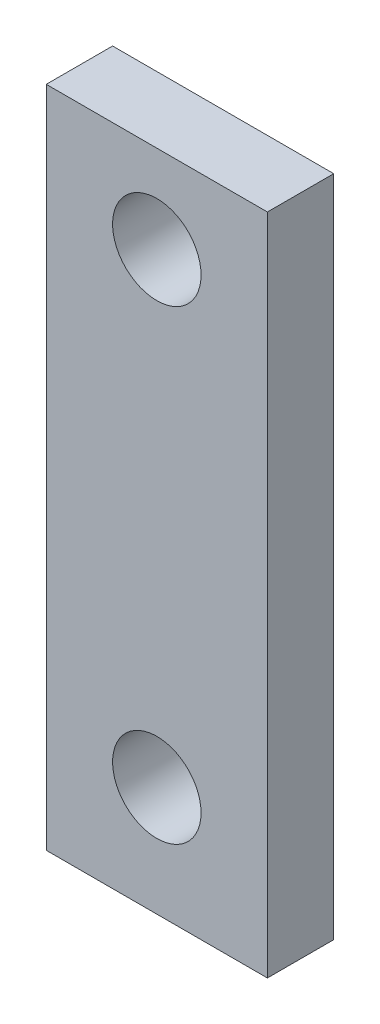
ISO-10303-21;
HEADER;
FILE_DESCRIPTION(('STEP AP214'),'2;1');
FILE_NAME('part.step','',(''),(''),'','','');
FILE_SCHEMA(('AUTOMOTIVE_DESIGN { 1 0 10303 214 1 1 1 1 }'));
ENDSEC;
DATA;
#1=APPLICATION_CONTEXT('core data for automotive mechanical design processes');
#2=APPLICATION_PROTOCOL_DEFINITION('international standard','automotive_design',2000,#1);
#3=PRODUCT_CONTEXT('',#1,'mechanical');
#4=PRODUCT('Part','Part','',(#3));
#5=PRODUCT_RELATED_PRODUCT_CATEGORY('part','',(#4));
#6=PRODUCT_DEFINITION_FORMATION('','',#4);
#7=PRODUCT_DEFINITION_CONTEXT('part definition',#1,'design');
#8=PRODUCT_DEFINITION('design','',#6,#7);
#9=PRODUCT_DEFINITION_SHAPE('','',#8);
#10=(LENGTH_UNIT() NAMED_UNIT(*) SI_UNIT(.MILLI.,.METRE.));
#11=(NAMED_UNIT(*) PLANE_ANGLE_UNIT() SI_UNIT($,.RADIAN.));
#12=(NAMED_UNIT(*) SI_UNIT($,.STERADIAN.) SOLID_ANGLE_UNIT());
#13=UNCERTAINTY_MEASURE_WITH_UNIT(LENGTH_MEASURE(1.E-05),#10,'distance_accuracy_value','');
#14=(GEOMETRIC_REPRESENTATION_CONTEXT(3) GLOBAL_UNCERTAINTY_ASSIGNED_CONTEXT((#13)) GLOBAL_UNIT_ASSIGNED_CONTEXT((#10,
#11,#12)) REPRESENTATION_CONTEXT('',''));
#15=CARTESIAN_POINT('',(0.,0.,0.));
#16=DIRECTION('',(0.,0.,1.));
#17=DIRECTION('',(1.,0.,0.));
#18=AXIS2_PLACEMENT_3D('',#15,#16,#17);
#19=CARTESIAN_POINT('',(5.,-15.,3.));
#20=DIRECTION('',(-1.,0.,0.));
#21=DIRECTION('',(0.,0.,1.));
#22=AXIS2_PLACEMENT_3D('',#19,#20,#21);
#23=PLANE('',#22);
#24=DIRECTION('',(0.,1.,0.));
#25=VECTOR('',#24,1.);
#26=CARTESIAN_POINT('',(5.,-15.,0.));
#27=LINE('',#26,#25);
#28=CARTESIAN_POINT('',(5.,-15.,0.));
#29=VERTEX_POINT('',#28);
#30=CARTESIAN_POINT('',(5.,15.,0.));
#31=VERTEX_POINT('',#30);
#32=EDGE_CURVE('E99',#29,#31,#27,.T.);
#33=ORIENTED_EDGE('',*,*,#32,.T.);
#34=DIRECTION('',(0.,0.,-1.));
#35=VECTOR('',#34,1.);
#36=CARTESIAN_POINT('',(5.,15.,3.));
#37=LINE('',#36,#35);
#38=CARTESIAN_POINT('',(5.,15.,3.));
#39=VERTEX_POINT('',#38);
#40=EDGE_CURVE('E11',#39,#31,#37,.T.);
#41=ORIENTED_EDGE('',*,*,#40,.F.);
#42=DIRECTION('',(0.,1.,0.));
#43=VECTOR('',#42,1.);
#44=CARTESIAN_POINT('',(5.,-15.,3.));
#45=LINE('',#44,#43);
#46=CARTESIAN_POINT('',(5.,-15.,3.));
#47=VERTEX_POINT('',#46);
#48=EDGE_CURVE('E86',#47,#39,#45,.T.);
#49=ORIENTED_EDGE('',*,*,#48,.F.);
#50=DIRECTION('',(0.,0.,-1.));
#51=VECTOR('',#50,1.);
#52=CARTESIAN_POINT('',(5.,-15.,3.));
#53=LINE('',#52,#51);
#54=EDGE_CURVE('E95',#47,#29,#53,.T.);
#55=ORIENTED_EDGE('',*,*,#54,.T.);
#56=EDGE_LOOP('',(#33,#41,#49,#55));
#57=FACE_BOUND('',#56,.T.);
#58=ADVANCED_FACE('F33',(#57),#23,.F.);
#59=CARTESIAN_POINT('',(-5.,15.,3.));
#60=DIRECTION('',(0.,-1.,0.));
#61=DIRECTION('',(0.,0.,-1.));
#62=AXIS2_PLACEMENT_3D('',#59,#60,#61);
#63=PLANE('',#62);
#64=DIRECTION('',(-1.,0.,0.));
#65=VECTOR('',#64,1.);
#66=CARTESIAN_POINT('',(-5.,15.,0.));
#67=LINE('',#66,#65);
#68=CARTESIAN_POINT('',(-5.,15.,0.));
#69=VERTEX_POINT('',#68);
#70=EDGE_CURVE('E90',#31,#69,#67,.T.);
#71=ORIENTED_EDGE('',*,*,#70,.T.);
#72=DIRECTION('',(0.,0.,-1.));
#73=VECTOR('',#72,1.);
#74=CARTESIAN_POINT('',(-5.,15.,3.));
#75=LINE('',#74,#73);
#76=CARTESIAN_POINT('',(-5.,15.,3.));
#77=VERTEX_POINT('',#76);
#78=EDGE_CURVE('E42',#77,#69,#75,.T.);
#79=ORIENTED_EDGE('',*,*,#78,.F.);
#80=DIRECTION('',(-1.,0.,0.));
#81=VECTOR('',#80,1.);
#82=CARTESIAN_POINT('',(-5.,15.,3.));
#83=LINE('',#82,#81);
#84=EDGE_CURVE('E81',#39,#77,#83,.T.);
#85=ORIENTED_EDGE('',*,*,#84,.F.);
#86=ORIENTED_EDGE('',*,*,#40,.T.);
#87=EDGE_LOOP('',(#71,#79,#85,#86));
#88=FACE_BOUND('',#87,.T.);
#89=ADVANCED_FACE('F89',(#88),#63,.F.);
#90=CARTESIAN_POINT('',(-5.,-15.,3.));
#91=DIRECTION('',(1.,0.,0.));
#92=DIRECTION('',(0.,0.,-1.));
#93=AXIS2_PLACEMENT_3D('',#90,#91,#92);
#94=PLANE('',#93);
#95=DIRECTION('',(0.,-1.,0.));
#96=VECTOR('',#95,1.);
#97=CARTESIAN_POINT('',(-5.,-15.,0.));
#98=LINE('',#97,#96);
#99=CARTESIAN_POINT('',(-5.,-15.,0.));
#100=VERTEX_POINT('',#99);
#101=EDGE_CURVE('E68',#69,#100,#98,.T.);
#102=ORIENTED_EDGE('',*,*,#101,.T.);
#103=DIRECTION('',(0.,0.,-1.));
#104=VECTOR('',#103,1.);
#105=CARTESIAN_POINT('',(-5.,-15.,3.));
#106=LINE('',#105,#104);
#107=CARTESIAN_POINT('',(-5.,-15.,3.));
#108=VERTEX_POINT('',#107);
#109=EDGE_CURVE('E91',#108,#100,#106,.T.);
#110=ORIENTED_EDGE('',*,*,#109,.F.);
#111=DIRECTION('',(0.,-1.,0.));
#112=VECTOR('',#111,1.);
#113=CARTESIAN_POINT('',(-5.,-15.,3.));
#114=LINE('',#113,#112);
#115=EDGE_CURVE('E84',#77,#108,#114,.T.);
#116=ORIENTED_EDGE('',*,*,#115,.F.);
#117=ORIENTED_EDGE('',*,*,#78,.T.);
#118=EDGE_LOOP('',(#102,#110,#116,#117));
#119=FACE_BOUND('',#118,.T.);
#120=ADVANCED_FACE('F93',(#119),#94,.F.);
#121=CARTESIAN_POINT('',(-5.,-15.,3.));
#122=DIRECTION('',(0.,1.,0.));
#123=DIRECTION('',(0.,0.,1.));
#124=AXIS2_PLACEMENT_3D('',#121,#122,#123);
#125=PLANE('',#124);
#126=DIRECTION('',(1.,0.,0.));
#127=VECTOR('',#126,1.);
#128=CARTESIAN_POINT('',(-5.,-15.,0.));
#129=LINE('',#128,#127);
#130=EDGE_CURVE('E74',#100,#29,#129,.T.);
#131=ORIENTED_EDGE('',*,*,#130,.T.);
#132=ORIENTED_EDGE('',*,*,#54,.F.);
#133=DIRECTION('',(1.,0.,0.));
#134=VECTOR('',#133,1.);
#135=CARTESIAN_POINT('',(-5.,-15.,3.));
#136=LINE('',#135,#134);
#137=EDGE_CURVE('E51',#108,#47,#136,.T.);
#138=ORIENTED_EDGE('',*,*,#137,.F.);
#139=ORIENTED_EDGE('',*,*,#109,.T.);
#140=EDGE_LOOP('',(#131,#132,#138,#139));
#141=FACE_BOUND('',#140,.T.);
#142=ADVANCED_FACE('F125',(#141),#125,.F.);
#143=CARTESIAN_POINT('',(0.,0.,3.));
#144=DIRECTION('',(0.,0.,-1.));
#145=DIRECTION('',(-1.,0.,0.));
#146=AXIS2_PLACEMENT_3D('',#143,#144,#145);
#147=PLANE('',#146);
#148=CARTESIAN_POINT('',(0.,11.0283207685349,3.));
#149=DIRECTION('',(0.,0.,1.));
#150=DIRECTION('',(1.,0.,0.));
#151=AXIS2_PLACEMENT_3D('',#148,#149,#150);
#152=CIRCLE('',#151,2.);
#153=CARTESIAN_POINT('',(2.,11.0283207685349,3.));
#154=VERTEX_POINT('',#153);
#155=EDGE_CURVE('E108',#154,#154,#152,.T.);
#156=ORIENTED_EDGE('',*,*,#155,.F.);
#157=EDGE_LOOP('',(#156));
#158=FACE_BOUND('',#157,.T.);
#159=CARTESIAN_POINT('',(0.,-10.0348996205035,3.));
#160=DIRECTION('',(0.,0.,1.));
#161=DIRECTION('',(1.,0.,0.));
#162=AXIS2_PLACEMENT_3D('',#159,#160,#161);
#163=CIRCLE('',#162,2.);
#164=CARTESIAN_POINT('',(2.,-10.0348996205035,3.));
#165=VERTEX_POINT('',#164);
#166=EDGE_CURVE('E113',#165,#165,#163,.T.);
#167=ORIENTED_EDGE('',*,*,#166,.F.);
#168=EDGE_LOOP('',(#167));
#169=FACE_BOUND('',#168,.T.);
#170=ORIENTED_EDGE('',*,*,#48,.T.);
#171=ORIENTED_EDGE('',*,*,#84,.T.);
#172=ORIENTED_EDGE('',*,*,#115,.T.);
#173=ORIENTED_EDGE('',*,*,#137,.T.);
#174=EDGE_LOOP('',(#170,#171,#172,#173));
#175=FACE_BOUND('',#174,.T.);
#176=ADVANCED_FACE('F82',(#158,#169,#175),#147,.F.);
#177=CARTESIAN_POINT('',(0.,0.,0.));
#178=DIRECTION('',(0.,0.,-1.));
#179=DIRECTION('',(-1.,0.,0.));
#180=AXIS2_PLACEMENT_3D('',#177,#178,#179);
#181=PLANE('',#180);
#182=CARTESIAN_POINT('',(0.,11.0283207685349,0.));
#183=DIRECTION('',(0.,0.,-1.));
#184=DIRECTION('',(-1.,0.,0.));
#185=AXIS2_PLACEMENT_3D('',#182,#183,#184);
#186=CIRCLE('',#185,2.);
#187=CARTESIAN_POINT('',(-2.,11.0283207685349,0.));
#188=VERTEX_POINT('',#187);
#189=EDGE_CURVE('E36',#188,#188,#186,.T.);
#190=ORIENTED_EDGE('',*,*,#189,.F.);
#191=EDGE_LOOP('',(#190));
#192=FACE_BOUND('',#191,.T.);
#193=CARTESIAN_POINT('',(0.,-10.0348996205035,0.));
#194=DIRECTION('',(0.,0.,-1.));
#195=DIRECTION('',(-1.,0.,0.));
#196=AXIS2_PLACEMENT_3D('',#193,#194,#195);
#197=CIRCLE('',#196,2.);
#198=CARTESIAN_POINT('',(-2.,-10.0348996205035,0.));
#199=VERTEX_POINT('',#198);
#200=EDGE_CURVE('E106',#199,#199,#197,.T.);
#201=ORIENTED_EDGE('',*,*,#200,.F.);
#202=EDGE_LOOP('',(#201));
#203=FACE_BOUND('',#202,.T.);
#204=ORIENTED_EDGE('',*,*,#32,.F.);
#205=ORIENTED_EDGE('',*,*,#130,.F.);
#206=ORIENTED_EDGE('',*,*,#101,.F.);
#207=ORIENTED_EDGE('',*,*,#70,.F.);
#208=EDGE_LOOP('',(#204,#205,#206,#207));
#209=FACE_BOUND('',#208,.T.);
#210=ADVANCED_FACE('F124',(#192,#203,#209),#181,.T.);
#211=CARTESIAN_POINT('',(0.,-10.0348996205035,-7.));
#212=DIRECTION('',(0.,0.,1.));
#213=DIRECTION('',(1.,0.,0.));
#214=AXIS2_PLACEMENT_3D('',#211,#212,#213);
#215=CYLINDRICAL_SURFACE('',#214,2.);
#216=ORIENTED_EDGE('',*,*,#200,.T.);
#217=EDGE_LOOP('',(#216));
#218=FACE_BOUND('',#217,.T.);
#219=ORIENTED_EDGE('',*,*,#166,.T.);
#220=EDGE_LOOP('',(#219));
#221=FACE_BOUND('',#220,.T.);
#222=ADVANCED_FACE('F121',(#218,#221),#215,.F.);
#223=CARTESIAN_POINT('',(0.,11.0283207685349,-7.));
#224=DIRECTION('',(0.,0.,1.));
#225=DIRECTION('',(1.,0.,0.));
#226=AXIS2_PLACEMENT_3D('',#223,#224,#225);
#227=CYLINDRICAL_SURFACE('',#226,2.);
#228=ORIENTED_EDGE('',*,*,#189,.T.);
#229=EDGE_LOOP('',(#228));
#230=FACE_BOUND('',#229,.T.);
#231=ORIENTED_EDGE('',*,*,#155,.T.);
#232=EDGE_LOOP('',(#231));
#233=FACE_BOUND('',#232,.T.);
#234=ADVANCED_FACE('F170',(#230,#233),#227,.F.);
#235=CLOSED_SHELL('',(#58,#89,#120,#142,#176,#210,#222,#234));
#236=MANIFOLD_SOLID_BREP('B2',#235);
#237=ADVANCED_BREP_SHAPE_REPRESENTATION('',(#18,#236),#14);
#238=SHAPE_DEFINITION_REPRESENTATION(#9,#237);
ENDSEC;
END-ISO-10303-21;
